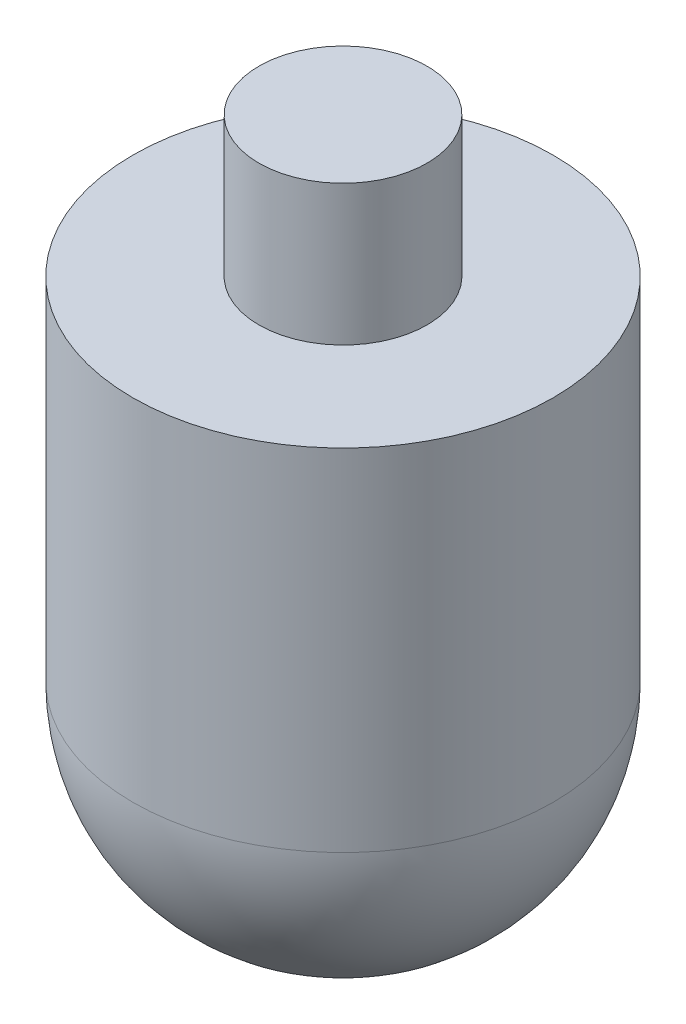
ISO-10303-21;
HEADER;
FILE_DESCRIPTION(('STEP AP214'),'2;1');
FILE_NAME('part.step','',(''),(''),'','','');
FILE_SCHEMA(('AUTOMOTIVE_DESIGN { 1 0 10303 214 1 1 1 1 }'));
ENDSEC;
DATA;
#1=APPLICATION_CONTEXT('core data for automotive mechanical design processes');
#2=APPLICATION_PROTOCOL_DEFINITION('international standard','automotive_design',2000,#1);
#3=PRODUCT_CONTEXT('',#1,'mechanical');
#4=PRODUCT('Part','Part','',(#3));
#5=PRODUCT_RELATED_PRODUCT_CATEGORY('part','',(#4));
#6=PRODUCT_DEFINITION_FORMATION('','',#4);
#7=PRODUCT_DEFINITION_CONTEXT('part definition',#1,'design');
#8=PRODUCT_DEFINITION('design','',#6,#7);
#9=PRODUCT_DEFINITION_SHAPE('','',#8);
#10=(LENGTH_UNIT() NAMED_UNIT(*) SI_UNIT(.MILLI.,.METRE.));
#11=(NAMED_UNIT(*) PLANE_ANGLE_UNIT() SI_UNIT($,.RADIAN.));
#12=(NAMED_UNIT(*) SI_UNIT($,.STERADIAN.) SOLID_ANGLE_UNIT());
#13=UNCERTAINTY_MEASURE_WITH_UNIT(LENGTH_MEASURE(1.E-05),#10,'distance_accuracy_value','');
#14=(GEOMETRIC_REPRESENTATION_CONTEXT(3) GLOBAL_UNCERTAINTY_ASSIGNED_CONTEXT((#13)) GLOBAL_UNIT_ASSIGNED_CONTEXT((#10,
#11,#12)) REPRESENTATION_CONTEXT('',''));
#15=CARTESIAN_POINT('',(0.,0.,0.));
#16=DIRECTION('',(0.,0.,1.));
#17=DIRECTION('',(1.,0.,0.));
#18=AXIS2_PLACEMENT_3D('',#15,#16,#17);
#19=CARTESIAN_POINT('',(0.,0.,0.));
#20=DIRECTION('',(0.,-1.,0.));
#21=DIRECTION('',(0.,0.,-1.));
#22=AXIS2_PLACEMENT_3D('',#19,#20,#21);
#23=PLANE('',#22);
#24=CARTESIAN_POINT('',(0.,0.,0.));
#25=DIRECTION('',(0.,1.,0.));
#26=DIRECTION('',(0.,0.,1.));
#27=AXIS2_PLACEMENT_3D('',#24,#25,#26);
#28=CIRCLE('',#27,6.);
#29=CARTESIAN_POINT('',(0.,0.,6.));
#30=VERTEX_POINT('',#29);
#31=EDGE_CURVE('E10',#30,#30,#28,.T.);
#32=ORIENTED_EDGE('',*,*,#31,.T.);
#33=EDGE_LOOP('',(#32));
#34=FACE_BOUND('',#33,.T.);
#35=ADVANCED_FACE('F31',(#34),#23,.F.);
#36=CARTESIAN_POINT('',(0.,10.75,0.));
#37=DIRECTION('',(0.,1.,0.));
#38=DIRECTION('',(0.,0.,1.));
#39=AXIS2_PLACEMENT_3D('',#36,#37,#38);
#40=CYLINDRICAL_SURFACE('',#39,6.);
#41=ORIENTED_EDGE('',*,*,#31,.F.);
#42=EDGE_LOOP('',(#41));
#43=FACE_BOUND('',#42,.T.);
#44=CARTESIAN_POINT('',(0.,-10.,0.));
#45=DIRECTION('',(0.,1.,0.));
#46=DIRECTION('',(0.,0.,1.));
#47=AXIS2_PLACEMENT_3D('',#44,#45,#46);
#48=CIRCLE('',#47,6.);
#49=CARTESIAN_POINT('',(0.,-10.,6.));
#50=VERTEX_POINT('',#49);
#51=EDGE_CURVE('E37',#50,#50,#48,.T.);
#52=ORIENTED_EDGE('',*,*,#51,.T.);
#53=EDGE_LOOP('',(#52));
#54=FACE_BOUND('',#53,.T.);
#55=ADVANCED_FACE('F63',(#43,#54),#40,.T.);
#56=CARTESIAN_POINT('',(6.,-10.,0.));
#57=DIRECTION('',(0.,-1.,0.));
#58=DIRECTION('',(0.,0.,-1.));
#59=AXIS2_PLACEMENT_3D('',#56,#57,#58);
#60=PLANE('',#59);
#61=ORIENTED_EDGE('',*,*,#51,.F.);
#62=EDGE_LOOP('',(#61));
#63=FACE_BOUND('',#62,.T.);
#64=CARTESIAN_POINT('',(0.,-10.,0.));
#65=DIRECTION('',(0.,1.,0.));
#66=DIRECTION('',(0.,0.,1.));
#67=AXIS2_PLACEMENT_3D('',#64,#65,#66);
#68=CIRCLE('',#67,15.);
#69=CARTESIAN_POINT('',(0.,-10.,15.));
#70=VERTEX_POINT('',#69);
#71=EDGE_CURVE('E41',#70,#70,#68,.T.);
#72=ORIENTED_EDGE('',*,*,#71,.T.);
#73=EDGE_LOOP('',(#72));
#74=FACE_BOUND('',#73,.T.);
#75=ADVANCED_FACE('F59',(#63,#74),#60,.F.);
#76=CARTESIAN_POINT('',(0.,10.75,0.));
#77=DIRECTION('',(0.,1.,0.));
#78=DIRECTION('',(0.,0.,1.));
#79=AXIS2_PLACEMENT_3D('',#76,#77,#78);
#80=CYLINDRICAL_SURFACE('',#79,15.);
#81=ORIENTED_EDGE('',*,*,#71,.F.);
#82=EDGE_LOOP('',(#81));
#83=FACE_BOUND('',#82,.T.);
#84=CARTESIAN_POINT('',(0.,-35.,0.));
#85=DIRECTION('',(0.,1.,0.));
#86=DIRECTION('',(0.,0.,1.));
#87=AXIS2_PLACEMENT_3D('',#84,#85,#86);
#88=CIRCLE('',#87,15.);
#89=CARTESIAN_POINT('',(0.,-35.,15.));
#90=VERTEX_POINT('',#89);
#91=EDGE_CURVE('E45',#90,#90,#88,.T.);
#92=ORIENTED_EDGE('',*,*,#91,.T.);
#93=EDGE_LOOP('',(#92));
#94=FACE_BOUND('',#93,.T.);
#95=ADVANCED_FACE('F51',(#83,#94),#80,.T.);
#96=CARTESIAN_POINT('',(0.,-35.,0.));
#97=DIRECTION('',(0.,1.,0.));
#98=DIRECTION('',(1.,0.,0.));
#99=AXIS2_PLACEMENT_3D('',#96,#97,#98);
#100=SPHERICAL_SURFACE('',#99,15.);
#101=ORIENTED_EDGE('',*,*,#91,.F.);
#102=EDGE_LOOP('',(#101));
#103=FACE_BOUND('',#102,.T.);
#104=ADVANCED_FACE('F53',(#103),#100,.T.);
#105=CLOSED_SHELL('',(#35,#55,#75,#95,#104));
#106=MANIFOLD_SOLID_BREP('B2',#105);
#107=ADVANCED_BREP_SHAPE_REPRESENTATION('',(#18,#106),#14);
#108=SHAPE_DEFINITION_REPRESENTATION(#9,#107);
ENDSEC;
END-ISO-10303-21;
